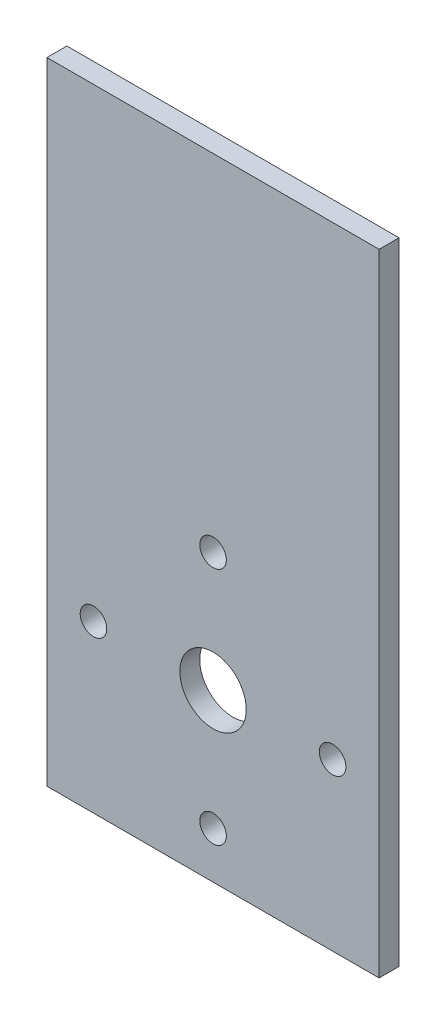
ISO-10303-21;
HEADER;
FILE_DESCRIPTION(('STEP AP214'),'2;1');
FILE_NAME('part.step','',(''),(''),'','','');
FILE_SCHEMA(('AUTOMOTIVE_DESIGN { 1 0 10303 214 1 1 1 1 }'));
ENDSEC;
DATA;
#1=APPLICATION_CONTEXT('core data for automotive mechanical design processes');
#2=APPLICATION_PROTOCOL_DEFINITION('international standard','automotive_design',2000,#1);
#3=PRODUCT_CONTEXT('',#1,'mechanical');
#4=PRODUCT('Part','Part','',(#3));
#5=PRODUCT_RELATED_PRODUCT_CATEGORY('part','',(#4));
#6=PRODUCT_DEFINITION_FORMATION('','',#4);
#7=PRODUCT_DEFINITION_CONTEXT('part definition',#1,'design');
#8=PRODUCT_DEFINITION('design','',#6,#7);
#9=PRODUCT_DEFINITION_SHAPE('','',#8);
#10=(LENGTH_UNIT() NAMED_UNIT(*) SI_UNIT(.MILLI.,.METRE.));
#11=(NAMED_UNIT(*) PLANE_ANGLE_UNIT() SI_UNIT($,.RADIAN.));
#12=(NAMED_UNIT(*) SI_UNIT($,.STERADIAN.) SOLID_ANGLE_UNIT());
#13=UNCERTAINTY_MEASURE_WITH_UNIT(LENGTH_MEASURE(1.E-05),#10,'distance_accuracy_value','');
#14=(GEOMETRIC_REPRESENTATION_CONTEXT(3) GLOBAL_UNCERTAINTY_ASSIGNED_CONTEXT((#13)) GLOBAL_UNIT_ASSIGNED_CONTEXT((#10,
#11,#12)) REPRESENTATION_CONTEXT('',''));
#15=CARTESIAN_POINT('',(0.,0.,0.));
#16=DIRECTION('',(0.,0.,1.));
#17=DIRECTION('',(1.,0.,0.));
#18=AXIS2_PLACEMENT_3D('',#15,#16,#17);
#19=CARTESIAN_POINT('',(0.,0.,3.));
#20=DIRECTION('',(0.,0.,1.));
#21=DIRECTION('',(1.,0.,0.));
#22=AXIS2_PLACEMENT_3D('',#19,#20,#21);
#23=PLANE('',#22);
#24=CARTESIAN_POINT('',(0.,43.,3.));
#25=DIRECTION('',(0.,0.,1.));
#26=DIRECTION('',(1.,0.,0.));
#27=AXIS2_PLACEMENT_3D('',#24,#25,#26);
#28=CIRCLE('',#27,2.);
#29=CARTESIAN_POINT('',(2.,43.,3.));
#30=VERTEX_POINT('',#29);
#31=EDGE_CURVE('E131',#30,#30,#28,.T.);
#32=ORIENTED_EDGE('',*,*,#31,.F.);
#33=EDGE_LOOP('',(#32));
#34=FACE_BOUND('',#33,.T.);
#35=CARTESIAN_POINT('',(18.,25.,3.));
#36=DIRECTION('',(0.,0.,1.));
#37=DIRECTION('',(1.,0.,0.));
#38=AXIS2_PLACEMENT_3D('',#35,#36,#37);
#39=CIRCLE('',#38,2.);
#40=CARTESIAN_POINT('',(20.,25.,3.));
#41=VERTEX_POINT('',#40);
#42=EDGE_CURVE('E162',#41,#41,#39,.T.);
#43=ORIENTED_EDGE('',*,*,#42,.F.);
#44=EDGE_LOOP('',(#43));
#45=FACE_BOUND('',#44,.T.);
#46=CARTESIAN_POINT('',(0.,7.,3.));
#47=DIRECTION('',(0.,0.,1.));
#48=DIRECTION('',(1.,0.,0.));
#49=AXIS2_PLACEMENT_3D('',#46,#47,#48);
#50=CIRCLE('',#49,2.);
#51=CARTESIAN_POINT('',(2.,7.,3.));
#52=VERTEX_POINT('',#51);
#53=EDGE_CURVE('E158',#52,#52,#50,.T.);
#54=ORIENTED_EDGE('',*,*,#53,.F.);
#55=EDGE_LOOP('',(#54));
#56=FACE_BOUND('',#55,.T.);
#57=CARTESIAN_POINT('',(-18.,25.,3.));
#58=DIRECTION('',(0.,0.,1.));
#59=DIRECTION('',(1.,0.,0.));
#60=AXIS2_PLACEMENT_3D('',#57,#58,#59);
#61=CIRCLE('',#60,2.00000000000001);
#62=CARTESIAN_POINT('',(-16.,25.,3.));
#63=VERTEX_POINT('',#62);
#64=EDGE_CURVE('E154',#63,#63,#61,.T.);
#65=ORIENTED_EDGE('',*,*,#64,.F.);
#66=EDGE_LOOP('',(#65));
#67=FACE_BOUND('',#66,.T.);
#68=DIRECTION('',(0.,-1.,0.));
#69=VECTOR('',#68,1.);
#70=CARTESIAN_POINT('',(-25.,95.,3.));
#71=LINE('',#70,#69);
#72=CARTESIAN_POINT('',(-25.,95.,3.));
#73=VERTEX_POINT('',#72);
#74=CARTESIAN_POINT('',(-25.,0.,3.));
#75=VERTEX_POINT('',#74);
#76=EDGE_CURVE('E94',#73,#75,#71,.T.);
#77=ORIENTED_EDGE('',*,*,#76,.T.);
#78=DIRECTION('',(1.,0.,0.));
#79=VECTOR('',#78,1.);
#80=CARTESIAN_POINT('',(-25.,0.,3.));
#81=LINE('',#80,#79);
#82=CARTESIAN_POINT('',(25.,0.,3.));
#83=VERTEX_POINT('',#82);
#84=EDGE_CURVE('E89',#75,#83,#81,.T.);
#85=ORIENTED_EDGE('',*,*,#84,.T.);
#86=DIRECTION('',(0.,1.,0.));
#87=VECTOR('',#86,1.);
#88=CARTESIAN_POINT('',(25.,95.,3.));
#89=LINE('',#88,#87);
#90=CARTESIAN_POINT('',(25.,95.,3.));
#91=VERTEX_POINT('',#90);
#92=EDGE_CURVE('E92',#83,#91,#89,.T.);
#93=ORIENTED_EDGE('',*,*,#92,.T.);
#94=DIRECTION('',(-1.,0.,0.));
#95=VECTOR('',#94,1.);
#96=CARTESIAN_POINT('',(-25.,95.,3.));
#97=LINE('',#96,#95);
#98=EDGE_CURVE('E59',#91,#73,#97,.T.);
#99=ORIENTED_EDGE('',*,*,#98,.T.);
#100=EDGE_LOOP('',(#77,#85,#93,#99));
#101=FACE_BOUND('',#100,.T.);
#102=CARTESIAN_POINT('',(0.,25.,3.));
#103=DIRECTION('',(0.,0.,1.));
#104=DIRECTION('',(1.,0.,0.));
#105=AXIS2_PLACEMENT_3D('',#102,#103,#104);
#106=CIRCLE('',#105,5.);
#107=CARTESIAN_POINT('',(5.,25.,3.));
#108=VERTEX_POINT('',#107);
#109=EDGE_CURVE('E115',#108,#108,#106,.T.);
#110=ORIENTED_EDGE('',*,*,#109,.F.);
#111=EDGE_LOOP('',(#110));
#112=FACE_BOUND('',#111,.T.);
#113=ADVANCED_FACE('F39',(#34,#45,#56,#67,#101,#112),#23,.T.);
#114=CARTESIAN_POINT('',(0.,0.,0.));
#115=DIRECTION('',(0.,0.,1.));
#116=DIRECTION('',(1.,0.,0.));
#117=AXIS2_PLACEMENT_3D('',#114,#115,#116);
#118=PLANE('',#117);
#119=CARTESIAN_POINT('',(0.,43.,0.));
#120=DIRECTION('',(0.,0.,1.));
#121=DIRECTION('',(1.,0.,0.));
#122=AXIS2_PLACEMENT_3D('',#119,#120,#121);
#123=CIRCLE('',#122,2.);
#124=CARTESIAN_POINT('',(2.,43.,0.));
#125=VERTEX_POINT('',#124);
#126=EDGE_CURVE('E43',#125,#125,#123,.T.);
#127=ORIENTED_EDGE('',*,*,#126,.T.);
#128=EDGE_LOOP('',(#127));
#129=FACE_BOUND('',#128,.T.);
#130=CARTESIAN_POINT('',(18.,25.,0.));
#131=DIRECTION('',(0.,0.,1.));
#132=DIRECTION('',(1.,0.,0.));
#133=AXIS2_PLACEMENT_3D('',#130,#131,#132);
#134=CIRCLE('',#133,2.);
#135=CARTESIAN_POINT('',(20.,25.,0.));
#136=VERTEX_POINT('',#135);
#137=EDGE_CURVE('E134',#136,#136,#134,.T.);
#138=ORIENTED_EDGE('',*,*,#137,.T.);
#139=EDGE_LOOP('',(#138));
#140=FACE_BOUND('',#139,.T.);
#141=CARTESIAN_POINT('',(0.,7.,0.));
#142=DIRECTION('',(0.,0.,1.));
#143=DIRECTION('',(1.,0.,0.));
#144=AXIS2_PLACEMENT_3D('',#141,#142,#143);
#145=CIRCLE('',#144,2.);
#146=CARTESIAN_POINT('',(2.,7.,0.));
#147=VERTEX_POINT('',#146);
#148=EDGE_CURVE('E130',#147,#147,#145,.T.);
#149=ORIENTED_EDGE('',*,*,#148,.T.);
#150=EDGE_LOOP('',(#149));
#151=FACE_BOUND('',#150,.T.);
#152=CARTESIAN_POINT('',(-18.,25.,0.));
#153=DIRECTION('',(0.,0.,1.));
#154=DIRECTION('',(1.,0.,0.));
#155=AXIS2_PLACEMENT_3D('',#152,#153,#154);
#156=CIRCLE('',#155,2.00000000000001);
#157=CARTESIAN_POINT('',(-16.,25.,0.));
#158=VERTEX_POINT('',#157);
#159=EDGE_CURVE('E126',#158,#158,#156,.T.);
#160=ORIENTED_EDGE('',*,*,#159,.T.);
#161=EDGE_LOOP('',(#160));
#162=FACE_BOUND('',#161,.T.);
#163=DIRECTION('',(0.,-1.,0.));
#164=VECTOR('',#163,1.);
#165=CARTESIAN_POINT('',(-25.,95.,0.));
#166=LINE('',#165,#164);
#167=CARTESIAN_POINT('',(-25.,95.,0.));
#168=VERTEX_POINT('',#167);
#169=CARTESIAN_POINT('',(-25.,0.,0.));
#170=VERTEX_POINT('',#169);
#171=EDGE_CURVE('E111',#168,#170,#166,.T.);
#172=ORIENTED_EDGE('',*,*,#171,.F.);
#173=DIRECTION('',(-1.,0.,0.));
#174=VECTOR('',#173,1.);
#175=CARTESIAN_POINT('',(-25.,95.,0.));
#176=LINE('',#175,#174);
#177=CARTESIAN_POINT('',(25.,95.,0.));
#178=VERTEX_POINT('',#177);
#179=EDGE_CURVE('E82',#178,#168,#176,.T.);
#180=ORIENTED_EDGE('',*,*,#179,.F.);
#181=DIRECTION('',(0.,1.,0.));
#182=VECTOR('',#181,1.);
#183=CARTESIAN_POINT('',(25.,95.,0.));
#184=LINE('',#183,#182);
#185=CARTESIAN_POINT('',(25.,0.,0.));
#186=VERTEX_POINT('',#185);
#187=EDGE_CURVE('E76',#186,#178,#184,.T.);
#188=ORIENTED_EDGE('',*,*,#187,.F.);
#189=DIRECTION('',(1.,0.,0.));
#190=VECTOR('',#189,1.);
#191=CARTESIAN_POINT('',(-25.,0.,0.));
#192=LINE('',#191,#190);
#193=EDGE_CURVE('E99',#170,#186,#192,.T.);
#194=ORIENTED_EDGE('',*,*,#193,.F.);
#195=EDGE_LOOP('',(#172,#180,#188,#194));
#196=FACE_BOUND('',#195,.T.);
#197=CARTESIAN_POINT('',(0.,25.,0.));
#198=DIRECTION('',(0.,0.,1.));
#199=DIRECTION('',(1.,0.,0.));
#200=AXIS2_PLACEMENT_3D('',#197,#198,#199);
#201=CIRCLE('',#200,5.);
#202=CARTESIAN_POINT('',(5.,25.,0.));
#203=VERTEX_POINT('',#202);
#204=EDGE_CURVE('E141',#203,#203,#201,.T.);
#205=ORIENTED_EDGE('',*,*,#204,.T.);
#206=EDGE_LOOP('',(#205));
#207=FACE_BOUND('',#206,.T.);
#208=ADVANCED_FACE('F175',(#129,#140,#151,#162,#196,#207),#118,.F.);
#209=CARTESIAN_POINT('',(-25.,95.,3.));
#210=DIRECTION('',(1.,0.,0.));
#211=DIRECTION('',(0.,1.,0.));
#212=AXIS2_PLACEMENT_3D('',#209,#210,#211);
#213=PLANE('',#212);
#214=ORIENTED_EDGE('',*,*,#171,.T.);
#215=DIRECTION('',(0.,0.,-1.));
#216=VECTOR('',#215,1.);
#217=CARTESIAN_POINT('',(-25.,0.,3.));
#218=LINE('',#217,#216);
#219=EDGE_CURVE('E11',#75,#170,#218,.T.);
#220=ORIENTED_EDGE('',*,*,#219,.F.);
#221=ORIENTED_EDGE('',*,*,#76,.F.);
#222=DIRECTION('',(0.,0.,-1.));
#223=VECTOR('',#222,1.);
#224=CARTESIAN_POINT('',(-25.,95.,3.));
#225=LINE('',#224,#223);
#226=EDGE_CURVE('E107',#73,#168,#225,.T.);
#227=ORIENTED_EDGE('',*,*,#226,.T.);
#228=EDGE_LOOP('',(#214,#220,#221,#227));
#229=FACE_BOUND('',#228,.T.);
#230=ADVANCED_FACE('F41',(#229),#213,.F.);
#231=CARTESIAN_POINT('',(-25.,0.,3.));
#232=DIRECTION('',(0.,1.,0.));
#233=DIRECTION('',(-1.,0.,0.));
#234=AXIS2_PLACEMENT_3D('',#231,#232,#233);
#235=PLANE('',#234);
#236=ORIENTED_EDGE('',*,*,#193,.T.);
#237=DIRECTION('',(0.,0.,-1.));
#238=VECTOR('',#237,1.);
#239=CARTESIAN_POINT('',(25.,0.,3.));
#240=LINE('',#239,#238);
#241=EDGE_CURVE('E50',#83,#186,#240,.T.);
#242=ORIENTED_EDGE('',*,*,#241,.F.);
#243=ORIENTED_EDGE('',*,*,#84,.F.);
#244=ORIENTED_EDGE('',*,*,#219,.T.);
#245=EDGE_LOOP('',(#236,#242,#243,#244));
#246=FACE_BOUND('',#245,.T.);
#247=ADVANCED_FACE('F98',(#246),#235,.F.);
#248=CARTESIAN_POINT('',(25.,95.,3.));
#249=DIRECTION('',(-1.,0.,0.));
#250=DIRECTION('',(0.,-1.,0.));
#251=AXIS2_PLACEMENT_3D('',#248,#249,#250);
#252=PLANE('',#251);
#253=ORIENTED_EDGE('',*,*,#187,.T.);
#254=DIRECTION('',(0.,0.,-1.));
#255=VECTOR('',#254,1.);
#256=CARTESIAN_POINT('',(25.,95.,3.));
#257=LINE('',#256,#255);
#258=EDGE_CURVE('E101',#91,#178,#257,.T.);
#259=ORIENTED_EDGE('',*,*,#258,.F.);
#260=ORIENTED_EDGE('',*,*,#92,.F.);
#261=ORIENTED_EDGE('',*,*,#241,.T.);
#262=EDGE_LOOP('',(#253,#259,#260,#261));
#263=FACE_BOUND('',#262,.T.);
#264=ADVANCED_FACE('F103',(#263),#252,.F.);
#265=CARTESIAN_POINT('',(-25.,95.,3.));
#266=DIRECTION('',(0.,-1.,0.));
#267=DIRECTION('',(1.,0.,0.));
#268=AXIS2_PLACEMENT_3D('',#265,#266,#267);
#269=PLANE('',#268);
#270=ORIENTED_EDGE('',*,*,#179,.T.);
#271=ORIENTED_EDGE('',*,*,#226,.F.);
#272=ORIENTED_EDGE('',*,*,#98,.F.);
#273=ORIENTED_EDGE('',*,*,#258,.T.);
#274=EDGE_LOOP('',(#270,#271,#272,#273));
#275=FACE_BOUND('',#274,.T.);
#276=ADVANCED_FACE('F196',(#275),#269,.F.);
#277=CARTESIAN_POINT('',(0.,25.,3.));
#278=DIRECTION('',(0.,0.,-1.));
#279=DIRECTION('',(-1.,0.,0.));
#280=AXIS2_PLACEMENT_3D('',#277,#278,#279);
#281=CYLINDRICAL_SURFACE('',#280,5.);
#282=ORIENTED_EDGE('',*,*,#109,.T.);
#283=EDGE_LOOP('',(#282));
#284=FACE_BOUND('',#283,.T.);
#285=ORIENTED_EDGE('',*,*,#204,.F.);
#286=EDGE_LOOP('',(#285));
#287=FACE_BOUND('',#286,.T.);
#288=ADVANCED_FACE('F187',(#284,#287),#281,.F.);
#289=CARTESIAN_POINT('',(-18.,25.,-7.));
#290=DIRECTION('',(0.,0.,1.));
#291=DIRECTION('',(1.,0.,0.));
#292=AXIS2_PLACEMENT_3D('',#289,#290,#291);
#293=CYLINDRICAL_SURFACE('',#292,2.00000000000001);
#294=ORIENTED_EDGE('',*,*,#64,.T.);
#295=EDGE_LOOP('',(#294));
#296=FACE_BOUND('',#295,.T.);
#297=ORIENTED_EDGE('',*,*,#159,.F.);
#298=EDGE_LOOP('',(#297));
#299=FACE_BOUND('',#298,.T.);
#300=ADVANCED_FACE('F183',(#296,#299),#293,.F.);
#301=CARTESIAN_POINT('',(0.,7.,-7.));
#302=DIRECTION('',(0.,0.,1.));
#303=DIRECTION('',(1.,0.,0.));
#304=AXIS2_PLACEMENT_3D('',#301,#302,#303);
#305=CYLINDRICAL_SURFACE('',#304,2.);
#306=ORIENTED_EDGE('',*,*,#53,.T.);
#307=EDGE_LOOP('',(#306));
#308=FACE_BOUND('',#307,.T.);
#309=ORIENTED_EDGE('',*,*,#148,.F.);
#310=EDGE_LOOP('',(#309));
#311=FACE_BOUND('',#310,.T.);
#312=ADVANCED_FACE('F186',(#308,#311),#305,.F.);
#313=CARTESIAN_POINT('',(18.,25.,-7.));
#314=DIRECTION('',(0.,0.,1.));
#315=DIRECTION('',(1.,0.,0.));
#316=AXIS2_PLACEMENT_3D('',#313,#314,#315);
#317=CYLINDRICAL_SURFACE('',#316,2.);
#318=ORIENTED_EDGE('',*,*,#42,.T.);
#319=EDGE_LOOP('',(#318));
#320=FACE_BOUND('',#319,.T.);
#321=ORIENTED_EDGE('',*,*,#137,.F.);
#322=EDGE_LOOP('',(#321));
#323=FACE_BOUND('',#322,.T.);
#324=ADVANCED_FACE('F256',(#320,#323),#317,.F.);
#325=CARTESIAN_POINT('',(0.,43.,-7.));
#326=DIRECTION('',(0.,0.,1.));
#327=DIRECTION('',(1.,0.,0.));
#328=AXIS2_PLACEMENT_3D('',#325,#326,#327);
#329=CYLINDRICAL_SURFACE('',#328,2.);
#330=ORIENTED_EDGE('',*,*,#31,.T.);
#331=EDGE_LOOP('',(#330));
#332=FACE_BOUND('',#331,.T.);
#333=ORIENTED_EDGE('',*,*,#126,.F.);
#334=EDGE_LOOP('',(#333));
#335=FACE_BOUND('',#334,.T.);
#336=ADVANCED_FACE('F170',(#332,#335),#329,.F.);
#337=CLOSED_SHELL('',(#113,#208,#230,#247,#264,#276,#288,#300,#312,#324,#336));
#338=MANIFOLD_SOLID_BREP('B2',#337);
#339=ADVANCED_BREP_SHAPE_REPRESENTATION('',(#18,#338),#14);
#340=SHAPE_DEFINITION_REPRESENTATION(#9,#339);
ENDSEC;
END-ISO-10303-21;
